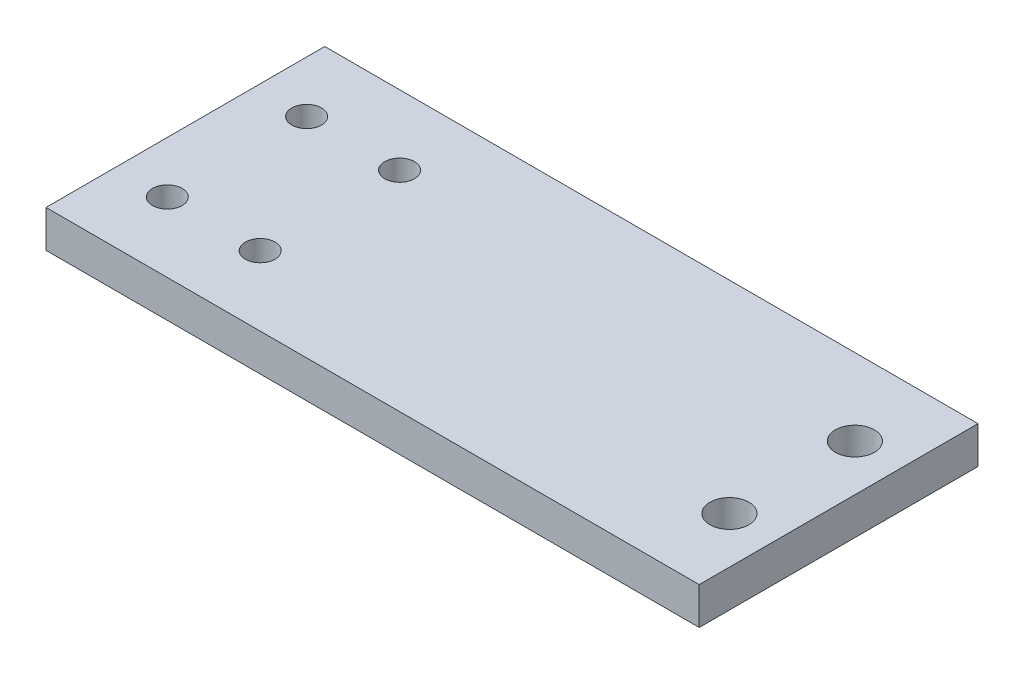
ISO-10303-21;
HEADER;
FILE_DESCRIPTION(('STEP AP214'),'2;1');
FILE_NAME('part.step','',(''),(''),'','','');
FILE_SCHEMA(('AUTOMOTIVE_DESIGN { 1 0 10303 214 1 1 1 1 }'));
ENDSEC;
DATA;
#1=APPLICATION_CONTEXT('core data for automotive mechanical design processes');
#2=APPLICATION_PROTOCOL_DEFINITION('international standard','automotive_design',2000,#1);
#3=PRODUCT_CONTEXT('',#1,'mechanical');
#4=PRODUCT('Part','Part','',(#3));
#5=PRODUCT_RELATED_PRODUCT_CATEGORY('part','',(#4));
#6=PRODUCT_DEFINITION_FORMATION('','',#4);
#7=PRODUCT_DEFINITION_CONTEXT('part definition',#1,'design');
#8=PRODUCT_DEFINITION('design','',#6,#7);
#9=PRODUCT_DEFINITION_SHAPE('','',#8);
#10=(LENGTH_UNIT() NAMED_UNIT(*) SI_UNIT(.MILLI.,.METRE.));
#11=(NAMED_UNIT(*) PLANE_ANGLE_UNIT() SI_UNIT($,.RADIAN.));
#12=(NAMED_UNIT(*) SI_UNIT($,.STERADIAN.) SOLID_ANGLE_UNIT());
#13=UNCERTAINTY_MEASURE_WITH_UNIT(LENGTH_MEASURE(1.E-05),#10,'distance_accuracy_value','');
#14=(GEOMETRIC_REPRESENTATION_CONTEXT(3) GLOBAL_UNCERTAINTY_ASSIGNED_CONTEXT((#13)) GLOBAL_UNIT_ASSIGNED_CONTEXT((#10,
#11,#12)) REPRESENTATION_CONTEXT('',''));
#15=CARTESIAN_POINT('',(0.,0.,0.));
#16=DIRECTION('',(0.,0.,1.));
#17=DIRECTION('',(1.,0.,0.));
#18=AXIS2_PLACEMENT_3D('',#15,#16,#17);
#19=CARTESIAN_POINT('',(0.,4.,0.));
#20=DIRECTION('',(0.,-1.,0.));
#21=DIRECTION('',(0.,0.,-1.));
#22=AXIS2_PLACEMENT_3D('',#19,#20,#21);
#23=PLANE('',#22);
#24=DIRECTION('',(-1.,0.,0.));
#25=VECTOR('',#24,1.);
#26=CARTESIAN_POINT('',(46.5518030757077,4.,-22.9980174917397));
#27=LINE('',#26,#25);
#28=CARTESIAN_POINT('',(46.5518030757077,4.,-22.9980174917397));
#29=VERTEX_POINT('',#28);
#30=CARTESIAN_POINT('',(-23.7481969242923,4.,-22.9980174917397));
#31=VERTEX_POINT('',#30);
#32=EDGE_CURVE('E90',#29,#31,#27,.T.);
#33=ORIENTED_EDGE('',*,*,#32,.T.);
#34=DIRECTION('',(0.,0.,1.));
#35=VECTOR('',#34,1.);
#36=CARTESIAN_POINT('',(-23.7481969242923,4.,7.00198250826034));
#37=LINE('',#36,#35);
#38=CARTESIAN_POINT('',(-23.7481969242923,4.,7.00198250826034));
#39=VERTEX_POINT('',#38);
#40=EDGE_CURVE('E85',#31,#39,#37,.T.);
#41=ORIENTED_EDGE('',*,*,#40,.T.);
#42=DIRECTION('',(1.,0.,0.));
#43=VECTOR('',#42,1.);
#44=CARTESIAN_POINT('',(46.5518030757077,4.,7.00198250826033));
#45=LINE('',#44,#43);
#46=CARTESIAN_POINT('',(46.5518030757077,4.,7.00198250826033));
#47=VERTEX_POINT('',#46);
#48=EDGE_CURVE('E88',#39,#47,#45,.T.);
#49=ORIENTED_EDGE('',*,*,#48,.T.);
#50=DIRECTION('',(0.,0.,-1.));
#51=VECTOR('',#50,1.);
#52=CARTESIAN_POINT('',(46.5518030757077,4.,-22.9980174917397));
#53=LINE('',#52,#51);
#54=EDGE_CURVE('E55',#47,#29,#53,.T.);
#55=ORIENTED_EDGE('',*,*,#54,.T.);
#56=EDGE_LOOP('',(#33,#41,#49,#55));
#57=FACE_BOUND('',#56,.T.);
#58=CARTESIAN_POINT('',(-18.1954887218045,4.,-15.4980174917397));
#59=DIRECTION('',(0.,1.,0.));
#60=DIRECTION('',(0.,0.,1.));
#61=AXIS2_PLACEMENT_3D('',#58,#59,#60);
#62=CIRCLE('',#61,1.6);
#63=CARTESIAN_POINT('',(-18.1954887218045,4.,-13.8980174917397));
#64=VERTEX_POINT('',#63);
#65=EDGE_CURVE('E105',#64,#64,#62,.T.);
#66=ORIENTED_EDGE('',*,*,#65,.F.);
#67=EDGE_LOOP('',(#66));
#68=FACE_BOUND('',#67,.T.);
#69=CARTESIAN_POINT('',(-18.1954887218045,4.,-0.498017491739666));
#70=DIRECTION('',(0.,1.,0.));
#71=DIRECTION('',(0.,0.,1.));
#72=AXIS2_PLACEMENT_3D('',#69,#70,#71);
#73=CIRCLE('',#72,1.6);
#74=CARTESIAN_POINT('',(-18.1954887218045,4.,1.10198250826034));
#75=VERTEX_POINT('',#74);
#76=EDGE_CURVE('E120',#75,#75,#73,.T.);
#77=ORIENTED_EDGE('',*,*,#76,.F.);
#78=EDGE_LOOP('',(#77));
#79=FACE_BOUND('',#78,.T.);
#80=CARTESIAN_POINT('',(-8.19548872180451,4.,-15.4980174917397));
#81=DIRECTION('',(0.,1.,0.));
#82=DIRECTION('',(0.,0.,1.));
#83=AXIS2_PLACEMENT_3D('',#80,#81,#82);
#84=CIRCLE('',#83,1.6);
#85=CARTESIAN_POINT('',(-8.19548872180451,4.,-13.8980174917397));
#86=VERTEX_POINT('',#85);
#87=EDGE_CURVE('E126',#86,#86,#84,.T.);
#88=ORIENTED_EDGE('',*,*,#87,.F.);
#89=EDGE_LOOP('',(#88));
#90=FACE_BOUND('',#89,.T.);
#91=CARTESIAN_POINT('',(-8.19548872180451,4.,-0.498017491739668));
#92=DIRECTION('',(0.,1.,0.));
#93=DIRECTION('',(0.,0.,1.));
#94=AXIS2_PLACEMENT_3D('',#91,#92,#93);
#95=CIRCLE('',#94,1.6);
#96=CARTESIAN_POINT('',(-8.19548872180451,4.,1.10198250826033));
#97=VERTEX_POINT('',#96);
#98=EDGE_CURVE('E132',#97,#97,#95,.T.);
#99=ORIENTED_EDGE('',*,*,#98,.F.);
#100=EDGE_LOOP('',(#99));
#101=FACE_BOUND('',#100,.T.);
#102=CARTESIAN_POINT('',(41.5518030757077,4.,-14.7480174917397));
#103=DIRECTION('',(0.,1.,0.));
#104=DIRECTION('',(0.,0.,1.));
#105=AXIS2_PLACEMENT_3D('',#102,#103,#104);
#106=CIRCLE('',#105,2.1);
#107=CARTESIAN_POINT('',(41.5518030757077,4.,-12.6480174917397));
#108=VERTEX_POINT('',#107);
#109=EDGE_CURVE('E138',#108,#108,#106,.T.);
#110=ORIENTED_EDGE('',*,*,#109,.F.);
#111=EDGE_LOOP('',(#110));
#112=FACE_BOUND('',#111,.T.);
#113=CARTESIAN_POINT('',(41.5518030757077,4.,-1.24801749173967));
#114=DIRECTION('',(0.,1.,0.));
#115=DIRECTION('',(0.,0.,-1.));
#116=AXIS2_PLACEMENT_3D('',#113,#114,#115);
#117=CIRCLE('',#116,2.1);
#118=CARTESIAN_POINT('',(41.5518030757077,4.,-3.34801749173966));
#119=VERTEX_POINT('',#118);
#120=EDGE_CURVE('E144',#119,#119,#117,.T.);
#121=ORIENTED_EDGE('',*,*,#120,.F.);
#122=EDGE_LOOP('',(#121));
#123=FACE_BOUND('',#122,.T.);
#124=ADVANCED_FACE('F38',(#57,#68,#79,#90,#101,#112,#123),#23,.F.);
#125=CARTESIAN_POINT('',(0.,0.,0.));
#126=DIRECTION('',(0.,-1.,0.));
#127=DIRECTION('',(0.,0.,-1.));
#128=AXIS2_PLACEMENT_3D('',#125,#126,#127);
#129=PLANE('',#128);
#130=CARTESIAN_POINT('',(41.5518030757077,0.,-14.7480174917397));
#131=DIRECTION('',(0.,1.,0.));
#132=DIRECTION('',(0.,0.,1.));
#133=AXIS2_PLACEMENT_3D('',#130,#131,#132);
#134=CIRCLE('',#133,2.1);
#135=CARTESIAN_POINT('',(41.5518030757077,0.,-12.6480174917397));
#136=VERTEX_POINT('',#135);
#137=EDGE_CURVE('E141',#136,#136,#134,.T.);
#138=ORIENTED_EDGE('',*,*,#137,.T.);
#139=EDGE_LOOP('',(#138));
#140=FACE_BOUND('',#139,.T.);
#141=CARTESIAN_POINT('',(-8.19548872180451,0.,-15.4980174917397));
#142=DIRECTION('',(0.,1.,0.));
#143=DIRECTION('',(0.,0.,1.));
#144=AXIS2_PLACEMENT_3D('',#141,#142,#143);
#145=CIRCLE('',#144,1.6);
#146=CARTESIAN_POINT('',(-8.19548872180451,0.,-13.8980174917397));
#147=VERTEX_POINT('',#146);
#148=EDGE_CURVE('E129',#147,#147,#145,.T.);
#149=ORIENTED_EDGE('',*,*,#148,.T.);
#150=EDGE_LOOP('',(#149));
#151=FACE_BOUND('',#150,.T.);
#152=CARTESIAN_POINT('',(-18.1954887218045,0.,-15.4980174917397));
#153=DIRECTION('',(0.,1.,0.));
#154=DIRECTION('',(0.,0.,1.));
#155=AXIS2_PLACEMENT_3D('',#152,#153,#154);
#156=CIRCLE('',#155,1.6);
#157=CARTESIAN_POINT('',(-18.1954887218045,0.,-13.8980174917397));
#158=VERTEX_POINT('',#157);
#159=EDGE_CURVE('E117',#158,#158,#156,.T.);
#160=ORIENTED_EDGE('',*,*,#159,.T.);
#161=EDGE_LOOP('',(#160));
#162=FACE_BOUND('',#161,.T.);
#163=DIRECTION('',(-1.,0.,0.));
#164=VECTOR('',#163,1.);
#165=CARTESIAN_POINT('',(46.5518030757077,0.,-22.9980174917397));
#166=LINE('',#165,#164);
#167=CARTESIAN_POINT('',(46.5518030757077,0.,-22.9980174917397));
#168=VERTEX_POINT('',#167);
#169=CARTESIAN_POINT('',(-23.7481969242923,0.,-22.9980174917397));
#170=VERTEX_POINT('',#169);
#171=EDGE_CURVE('E102',#168,#170,#166,.T.);
#172=ORIENTED_EDGE('',*,*,#171,.F.);
#173=DIRECTION('',(0.,0.,-1.));
#174=VECTOR('',#173,1.);
#175=CARTESIAN_POINT('',(46.5518030757077,0.,-22.9980174917397));
#176=LINE('',#175,#174);
#177=CARTESIAN_POINT('',(46.5518030757077,0.,7.00198250826033));
#178=VERTEX_POINT('',#177);
#179=EDGE_CURVE('E78',#178,#168,#176,.T.);
#180=ORIENTED_EDGE('',*,*,#179,.F.);
#181=DIRECTION('',(1.,0.,0.));
#182=VECTOR('',#181,1.);
#183=CARTESIAN_POINT('',(46.5518030757077,0.,7.00198250826033));
#184=LINE('',#183,#182);
#185=CARTESIAN_POINT('',(-23.7481969242923,0.,7.00198250826034));
#186=VERTEX_POINT('',#185);
#187=EDGE_CURVE('E72',#186,#178,#184,.T.);
#188=ORIENTED_EDGE('',*,*,#187,.F.);
#189=DIRECTION('',(0.,0.,1.));
#190=VECTOR('',#189,1.);
#191=CARTESIAN_POINT('',(-23.7481969242923,0.,7.00198250826034));
#192=LINE('',#191,#190);
#193=EDGE_CURVE('E94',#170,#186,#192,.T.);
#194=ORIENTED_EDGE('',*,*,#193,.F.);
#195=EDGE_LOOP('',(#172,#180,#188,#194));
#196=FACE_BOUND('',#195,.T.);
#197=CARTESIAN_POINT('',(-18.1954887218045,0.,-0.498017491739666));
#198=DIRECTION('',(0.,1.,0.));
#199=DIRECTION('',(0.,0.,1.));
#200=AXIS2_PLACEMENT_3D('',#197,#198,#199);
#201=CIRCLE('',#200,1.6);
#202=CARTESIAN_POINT('',(-18.1954887218045,0.,1.10198250826034));
#203=VERTEX_POINT('',#202);
#204=EDGE_CURVE('E123',#203,#203,#201,.T.);
#205=ORIENTED_EDGE('',*,*,#204,.T.);
#206=EDGE_LOOP('',(#205));
#207=FACE_BOUND('',#206,.T.);
#208=CARTESIAN_POINT('',(-8.19548872180451,0.,-0.498017491739668));
#209=DIRECTION('',(0.,1.,0.));
#210=DIRECTION('',(0.,0.,1.));
#211=AXIS2_PLACEMENT_3D('',#208,#209,#210);
#212=CIRCLE('',#211,1.6);
#213=CARTESIAN_POINT('',(-8.19548872180451,0.,1.10198250826033));
#214=VERTEX_POINT('',#213);
#215=EDGE_CURVE('E135',#214,#214,#212,.T.);
#216=ORIENTED_EDGE('',*,*,#215,.T.);
#217=EDGE_LOOP('',(#216));
#218=FACE_BOUND('',#217,.T.);
#219=CARTESIAN_POINT('',(41.5518030757077,0.,-1.24801749173967));
#220=DIRECTION('',(0.,1.,0.));
#221=DIRECTION('',(0.,0.,-1.));
#222=AXIS2_PLACEMENT_3D('',#219,#220,#221);
#223=CIRCLE('',#222,2.1);
#224=CARTESIAN_POINT('',(41.5518030757077,0.,-3.34801749173966));
#225=VERTEX_POINT('',#224);
#226=EDGE_CURVE('E147',#225,#225,#223,.T.);
#227=ORIENTED_EDGE('',*,*,#226,.T.);
#228=EDGE_LOOP('',(#227));
#229=FACE_BOUND('',#228,.T.);
#230=ADVANCED_FACE('F113',(#140,#151,#162,#196,#207,#218,#229),#129,.T.);
#231=CARTESIAN_POINT('',(46.5518030757077,4.,-22.9980174917397));
#232=DIRECTION('',(0.,0.,1.));
#233=DIRECTION('',(1.,0.,0.));
#234=AXIS2_PLACEMENT_3D('',#231,#232,#233);
#235=PLANE('',#234);
#236=ORIENTED_EDGE('',*,*,#171,.T.);
#237=DIRECTION('',(0.,-1.,0.));
#238=VECTOR('',#237,1.);
#239=CARTESIAN_POINT('',(-23.7481969242923,4.,-22.9980174917397));
#240=LINE('',#239,#238);
#241=EDGE_CURVE('E11',#31,#170,#240,.T.);
#242=ORIENTED_EDGE('',*,*,#241,.F.);
#243=ORIENTED_EDGE('',*,*,#32,.F.);
#244=DIRECTION('',(0.,-1.,0.));
#245=VECTOR('',#244,1.);
#246=CARTESIAN_POINT('',(46.5518030757077,4.,-22.9980174917397));
#247=LINE('',#246,#245);
#248=EDGE_CURVE('E98',#29,#168,#247,.T.);
#249=ORIENTED_EDGE('',*,*,#248,.T.);
#250=EDGE_LOOP('',(#236,#242,#243,#249));
#251=FACE_BOUND('',#250,.T.);
#252=ADVANCED_FACE('F40',(#251),#235,.F.);
#253=CARTESIAN_POINT('',(-23.7481969242923,4.,7.00198250826034));
#254=DIRECTION('',(1.,0.,0.));
#255=DIRECTION('',(0.,0.,-1.));
#256=AXIS2_PLACEMENT_3D('',#253,#254,#255);
#257=PLANE('',#256);
#258=ORIENTED_EDGE('',*,*,#193,.T.);
#259=DIRECTION('',(0.,-1.,0.));
#260=VECTOR('',#259,1.);
#261=CARTESIAN_POINT('',(-23.7481969242923,4.,7.00198250826034));
#262=LINE('',#261,#260);
#263=EDGE_CURVE('E47',#39,#186,#262,.T.);
#264=ORIENTED_EDGE('',*,*,#263,.F.);
#265=ORIENTED_EDGE('',*,*,#40,.F.);
#266=ORIENTED_EDGE('',*,*,#241,.T.);
#267=EDGE_LOOP('',(#258,#264,#265,#266));
#268=FACE_BOUND('',#267,.T.);
#269=ADVANCED_FACE('F93',(#268),#257,.F.);
#270=CARTESIAN_POINT('',(46.5518030757077,4.,7.00198250826033));
#271=DIRECTION('',(0.,0.,-1.));
#272=DIRECTION('',(-1.,0.,0.));
#273=AXIS2_PLACEMENT_3D('',#270,#271,#272);
#274=PLANE('',#273);
#275=ORIENTED_EDGE('',*,*,#187,.T.);
#276=DIRECTION('',(0.,-1.,0.));
#277=VECTOR('',#276,1.);
#278=CARTESIAN_POINT('',(46.5518030757077,4.,7.00198250826033));
#279=LINE('',#278,#277);
#280=EDGE_CURVE('E95',#47,#178,#279,.T.);
#281=ORIENTED_EDGE('',*,*,#280,.F.);
#282=ORIENTED_EDGE('',*,*,#48,.F.);
#283=ORIENTED_EDGE('',*,*,#263,.T.);
#284=EDGE_LOOP('',(#275,#281,#282,#283));
#285=FACE_BOUND('',#284,.T.);
#286=ADVANCED_FACE('F96',(#285),#274,.F.);
#287=CARTESIAN_POINT('',(46.5518030757077,4.,-22.9980174917397));
#288=DIRECTION('',(-1.,0.,0.));
#289=DIRECTION('',(0.,0.,1.));
#290=AXIS2_PLACEMENT_3D('',#287,#288,#289);
#291=PLANE('',#290);
#292=ORIENTED_EDGE('',*,*,#179,.T.);
#293=ORIENTED_EDGE('',*,*,#248,.F.);
#294=ORIENTED_EDGE('',*,*,#54,.F.);
#295=ORIENTED_EDGE('',*,*,#280,.T.);
#296=EDGE_LOOP('',(#292,#293,#294,#295));
#297=FACE_BOUND('',#296,.T.);
#298=ADVANCED_FACE('F110',(#297),#291,.F.);
#299=CARTESIAN_POINT('',(-18.1954887218045,4.,-15.4980174917397));
#300=DIRECTION('',(0.,-1.,0.));
#301=DIRECTION('',(0.,0.,-1.));
#302=AXIS2_PLACEMENT_3D('',#299,#300,#301);
#303=CYLINDRICAL_SURFACE('',#302,1.6);
#304=ORIENTED_EDGE('',*,*,#65,.T.);
#305=EDGE_LOOP('',(#304));
#306=FACE_BOUND('',#305,.T.);
#307=ORIENTED_EDGE('',*,*,#159,.F.);
#308=EDGE_LOOP('',(#307));
#309=FACE_BOUND('',#308,.T.);
#310=ADVANCED_FACE('F164',(#306,#309),#303,.F.);
#311=CARTESIAN_POINT('',(-18.1954887218045,4.,-0.498017491739666));
#312=DIRECTION('',(0.,-1.,0.));
#313=DIRECTION('',(0.,0.,-1.));
#314=AXIS2_PLACEMENT_3D('',#311,#312,#313);
#315=CYLINDRICAL_SURFACE('',#314,1.6);
#316=ORIENTED_EDGE('',*,*,#76,.T.);
#317=EDGE_LOOP('',(#316));
#318=FACE_BOUND('',#317,.T.);
#319=ORIENTED_EDGE('',*,*,#204,.F.);
#320=EDGE_LOOP('',(#319));
#321=FACE_BOUND('',#320,.T.);
#322=ADVANCED_FACE('F218',(#318,#321),#315,.F.);
#323=CARTESIAN_POINT('',(-8.19548872180451,4.,-15.4980174917397));
#324=DIRECTION('',(0.,-1.,0.));
#325=DIRECTION('',(0.,0.,-1.));
#326=AXIS2_PLACEMENT_3D('',#323,#324,#325);
#327=CYLINDRICAL_SURFACE('',#326,1.6);
#328=ORIENTED_EDGE('',*,*,#87,.T.);
#329=EDGE_LOOP('',(#328));
#330=FACE_BOUND('',#329,.T.);
#331=ORIENTED_EDGE('',*,*,#148,.F.);
#332=EDGE_LOOP('',(#331));
#333=FACE_BOUND('',#332,.T.);
#334=ADVANCED_FACE('F227',(#330,#333),#327,.F.);
#335=CARTESIAN_POINT('',(-8.19548872180451,4.,-0.498017491739668));
#336=DIRECTION('',(0.,-1.,0.));
#337=DIRECTION('',(0.,0.,-1.));
#338=AXIS2_PLACEMENT_3D('',#335,#336,#337);
#339=CYLINDRICAL_SURFACE('',#338,1.6);
#340=ORIENTED_EDGE('',*,*,#98,.T.);
#341=EDGE_LOOP('',(#340));
#342=FACE_BOUND('',#341,.T.);
#343=ORIENTED_EDGE('',*,*,#215,.F.);
#344=EDGE_LOOP('',(#343));
#345=FACE_BOUND('',#344,.T.);
#346=ADVANCED_FACE('F236',(#342,#345),#339,.F.);
#347=CARTESIAN_POINT('',(41.5518030757077,4.,-14.7480174917397));
#348=DIRECTION('',(0.,-1.,0.));
#349=DIRECTION('',(0.,0.,-1.));
#350=AXIS2_PLACEMENT_3D('',#347,#348,#349);
#351=CYLINDRICAL_SURFACE('',#350,2.1);
#352=ORIENTED_EDGE('',*,*,#109,.T.);
#353=EDGE_LOOP('',(#352));
#354=FACE_BOUND('',#353,.T.);
#355=ORIENTED_EDGE('',*,*,#137,.F.);
#356=EDGE_LOOP('',(#355));
#357=FACE_BOUND('',#356,.T.);
#358=ADVANCED_FACE('F246',(#354,#357),#351,.F.);
#359=CARTESIAN_POINT('',(41.5518030757077,4.,-1.24801749173967));
#360=DIRECTION('',(0.,-1.,0.));
#361=DIRECTION('',(0.,0.,-1.));
#362=AXIS2_PLACEMENT_3D('',#359,#360,#361);
#363=CYLINDRICAL_SURFACE('',#362,2.1);
#364=ORIENTED_EDGE('',*,*,#120,.T.);
#365=EDGE_LOOP('',(#364));
#366=FACE_BOUND('',#365,.T.);
#367=ORIENTED_EDGE('',*,*,#226,.F.);
#368=EDGE_LOOP('',(#367));
#369=FACE_BOUND('',#368,.T.);
#370=ADVANCED_FACE('F153',(#366,#369),#363,.F.);
#371=CLOSED_SHELL('',(#124,#230,#252,#269,#286,#298,#310,#322,#334,#346,#358,#370));
#372=MANIFOLD_SOLID_BREP('B2',#371);
#373=ADVANCED_BREP_SHAPE_REPRESENTATION('',(#18,#372),#14);
#374=SHAPE_DEFINITION_REPRESENTATION(#9,#373);
ENDSEC;
END-ISO-10303-21;
